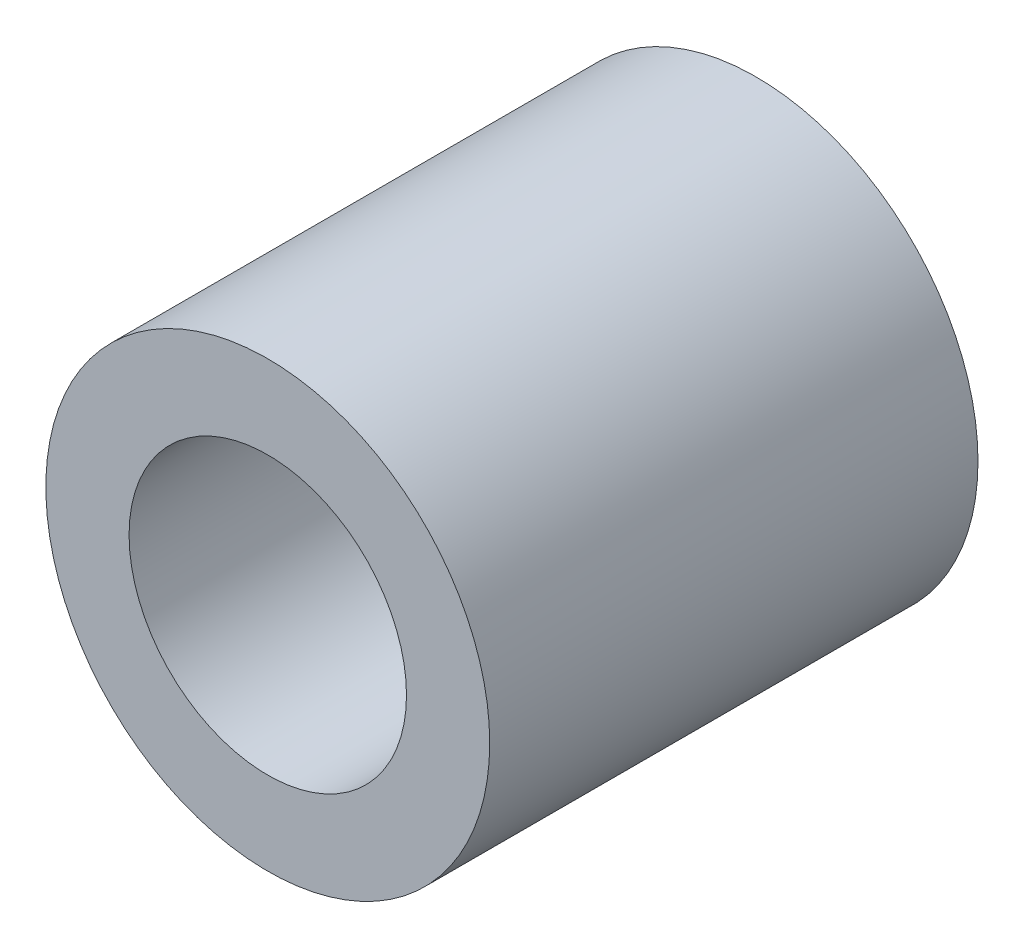
ISO-10303-21;
HEADER;
FILE_DESCRIPTION(('STEP AP214'),'2;1');
FILE_NAME('part.step','',(''),(''),'','','');
FILE_SCHEMA(('AUTOMOTIVE_DESIGN { 1 0 10303 214 1 1 1 1 }'));
ENDSEC;
DATA;
#1=APPLICATION_CONTEXT('core data for automotive mechanical design processes');
#2=APPLICATION_PROTOCOL_DEFINITION('international standard','automotive_design',2000,#1);
#3=PRODUCT_CONTEXT('',#1,'mechanical');
#4=PRODUCT('Part','Part','',(#3));
#5=PRODUCT_RELATED_PRODUCT_CATEGORY('part','',(#4));
#6=PRODUCT_DEFINITION_FORMATION('','',#4);
#7=PRODUCT_DEFINITION_CONTEXT('part definition',#1,'design');
#8=PRODUCT_DEFINITION('design','',#6,#7);
#9=PRODUCT_DEFINITION_SHAPE('','',#8);
#10=(LENGTH_UNIT() NAMED_UNIT(*) SI_UNIT(.MILLI.,.METRE.));
#11=(NAMED_UNIT(*) PLANE_ANGLE_UNIT() SI_UNIT($,.RADIAN.));
#12=(NAMED_UNIT(*) SI_UNIT($,.STERADIAN.) SOLID_ANGLE_UNIT());
#13=UNCERTAINTY_MEASURE_WITH_UNIT(LENGTH_MEASURE(1.E-05),#10,'distance_accuracy_value','');
#14=(GEOMETRIC_REPRESENTATION_CONTEXT(3) GLOBAL_UNCERTAINTY_ASSIGNED_CONTEXT((#13)) GLOBAL_UNIT_ASSIGNED_CONTEXT((#10,
#11,#12)) REPRESENTATION_CONTEXT('',''));
#15=CARTESIAN_POINT('',(0.,0.,0.));
#16=DIRECTION('',(0.,0.,1.));
#17=DIRECTION('',(1.,0.,0.));
#18=AXIS2_PLACEMENT_3D('',#15,#16,#17);
#19=CARTESIAN_POINT('',(-98.1559817290321,22.86,13.97));
#20=DIRECTION('',(0.,0.,-1.));
#21=DIRECTION('',(-1.,0.,0.));
#22=AXIS2_PLACEMENT_3D('',#19,#20,#21);
#23=CYLINDRICAL_SURFACE('',#22,3.96875000000001);
#24=CARTESIAN_POINT('',(-98.1559817290321,22.86,13.97));
#25=DIRECTION('',(0.,0.,1.));
#26=DIRECTION('',(1.,0.,0.));
#27=AXIS2_PLACEMENT_3D('',#24,#25,#26);
#28=CIRCLE('',#27,3.96875000000001);
#29=CARTESIAN_POINT('',(-94.1872317290321,22.86,13.97));
#30=VERTEX_POINT('',#29);
#31=EDGE_CURVE('E40',#30,#30,#28,.T.);
#32=ORIENTED_EDGE('',*,*,#31,.T.);
#33=EDGE_LOOP('',(#32));
#34=FACE_BOUND('',#33,.T.);
#35=CARTESIAN_POINT('',(-98.1559817290321,22.86,0.));
#36=DIRECTION('',(0.,0.,1.));
#37=DIRECTION('',(1.,0.,0.));
#38=AXIS2_PLACEMENT_3D('',#35,#36,#37);
#39=CIRCLE('',#38,3.96875000000001);
#40=CARTESIAN_POINT('',(-94.1872317290321,22.86,0.));
#41=VERTEX_POINT('',#40);
#42=EDGE_CURVE('E46',#41,#41,#39,.T.);
#43=ORIENTED_EDGE('',*,*,#42,.F.);
#44=EDGE_LOOP('',(#43));
#45=FACE_BOUND('',#44,.T.);
#46=ADVANCED_FACE('F33',(#34,#45),#23,.F.);
#47=CARTESIAN_POINT('',(-98.1559817290321,22.86,13.97));
#48=DIRECTION('',(0.,0.,-1.));
#49=DIRECTION('',(-1.,0.,0.));
#50=AXIS2_PLACEMENT_3D('',#47,#48,#49);
#51=CYLINDRICAL_SURFACE('',#50,6.35);
#52=CARTESIAN_POINT('',(-98.1559817290321,22.86,13.97));
#53=DIRECTION('',(0.,0.,1.));
#54=DIRECTION('',(1.,0.,0.));
#55=AXIS2_PLACEMENT_3D('',#52,#53,#54);
#56=CIRCLE('',#55,6.35);
#57=CARTESIAN_POINT('',(-91.8059817290321,22.86,13.97));
#58=VERTEX_POINT('',#57);
#59=EDGE_CURVE('E10',#58,#58,#56,.T.);
#60=ORIENTED_EDGE('',*,*,#59,.F.);
#61=EDGE_LOOP('',(#60));
#62=FACE_BOUND('',#61,.T.);
#63=CARTESIAN_POINT('',(-98.1559817290321,22.86,0.));
#64=DIRECTION('',(0.,0.,1.));
#65=DIRECTION('',(1.,0.,0.));
#66=AXIS2_PLACEMENT_3D('',#63,#64,#65);
#67=CIRCLE('',#66,6.35);
#68=CARTESIAN_POINT('',(-91.8059817290321,22.86,0.));
#69=VERTEX_POINT('',#68);
#70=EDGE_CURVE('E36',#69,#69,#67,.T.);
#71=ORIENTED_EDGE('',*,*,#70,.T.);
#72=EDGE_LOOP('',(#71));
#73=FACE_BOUND('',#72,.T.);
#74=ADVANCED_FACE('F53',(#62,#73),#51,.T.);
#75=CARTESIAN_POINT('',(0.,0.,13.97));
#76=DIRECTION('',(0.,0.,1.));
#77=DIRECTION('',(1.,0.,0.));
#78=AXIS2_PLACEMENT_3D('',#75,#76,#77);
#79=PLANE('',#78);
#80=ORIENTED_EDGE('',*,*,#31,.F.);
#81=EDGE_LOOP('',(#80));
#82=FACE_BOUND('',#81,.T.);
#83=ORIENTED_EDGE('',*,*,#59,.T.);
#84=EDGE_LOOP('',(#83));
#85=FACE_BOUND('',#84,.T.);
#86=ADVANCED_FACE('F57',(#82,#85),#79,.T.);
#87=CARTESIAN_POINT('',(0.,0.,0.));
#88=DIRECTION('',(0.,0.,1.));
#89=DIRECTION('',(1.,0.,0.));
#90=AXIS2_PLACEMENT_3D('',#87,#88,#89);
#91=PLANE('',#90);
#92=ORIENTED_EDGE('',*,*,#42,.T.);
#93=EDGE_LOOP('',(#92));
#94=FACE_BOUND('',#93,.T.);
#95=ORIENTED_EDGE('',*,*,#70,.F.);
#96=EDGE_LOOP('',(#95));
#97=FACE_BOUND('',#96,.T.);
#98=ADVANCED_FACE('F55',(#94,#97),#91,.F.);
#99=CLOSED_SHELL('',(#46,#74,#86,#98));
#100=MANIFOLD_SOLID_BREP('B2',#99);
#101=ADVANCED_BREP_SHAPE_REPRESENTATION('',(#18,#100),#14);
#102=SHAPE_DEFINITION_REPRESENTATION(#9,#101);
ENDSEC;
END-ISO-10303-21;
